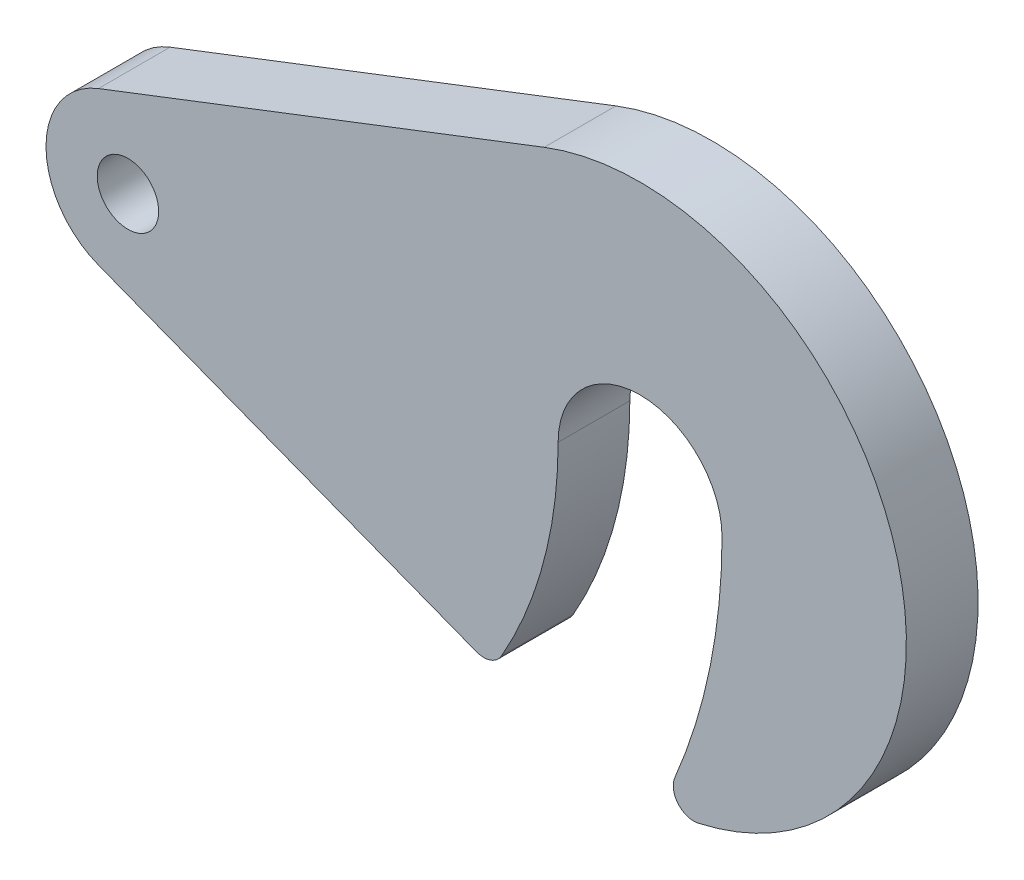
ISO-10303-21;
HEADER;
FILE_DESCRIPTION(('STEP AP214'),'2;1');
FILE_NAME('part.step','',(''),(''),'','','');
FILE_SCHEMA(('AUTOMOTIVE_DESIGN { 1 0 10303 214 1 1 1 1 }'));
ENDSEC;
DATA;
#1=APPLICATION_CONTEXT('core data for automotive mechanical design processes');
#2=APPLICATION_PROTOCOL_DEFINITION('international standard','automotive_design',2000,#1);
#3=PRODUCT_CONTEXT('',#1,'mechanical');
#4=PRODUCT('Part','Part','',(#3));
#5=PRODUCT_RELATED_PRODUCT_CATEGORY('part','',(#4));
#6=PRODUCT_DEFINITION_FORMATION('','',#4);
#7=PRODUCT_DEFINITION_CONTEXT('part definition',#1,'design');
#8=PRODUCT_DEFINITION('design','',#6,#7);
#9=PRODUCT_DEFINITION_SHAPE('','',#8);
#10=(LENGTH_UNIT() NAMED_UNIT(*) SI_UNIT(.MILLI.,.METRE.));
#11=(NAMED_UNIT(*) PLANE_ANGLE_UNIT() SI_UNIT($,.RADIAN.));
#12=(NAMED_UNIT(*) SI_UNIT($,.STERADIAN.) SOLID_ANGLE_UNIT());
#13=UNCERTAINTY_MEASURE_WITH_UNIT(LENGTH_MEASURE(1.E-05),#10,'distance_accuracy_value','');
#14=(GEOMETRIC_REPRESENTATION_CONTEXT(3) GLOBAL_UNCERTAINTY_ASSIGNED_CONTEXT((#13)) GLOBAL_UNIT_ASSIGNED_CONTEXT((#10,
#11,#12)) REPRESENTATION_CONTEXT('',''));
#15=CARTESIAN_POINT('',(0.,0.,0.));
#16=DIRECTION('',(0.,0.,1.));
#17=DIRECTION('',(1.,0.,0.));
#18=AXIS2_PLACEMENT_3D('',#15,#16,#17);
#19=CARTESIAN_POINT('',(0.,0.,7.));
#20=DIRECTION('',(0.,0.,1.));
#21=DIRECTION('',(1.,0.,0.));
#22=AXIS2_PLACEMENT_3D('',#19,#20,#21);
#23=PLANE('',#22);
#24=CARTESIAN_POINT('',(0.,0.,7.));
#25=DIRECTION('',(0.,0.,1.));
#26=DIRECTION('',(1.,0.,0.));
#27=AXIS2_PLACEMENT_3D('',#24,#25,#26);
#28=CIRCLE('',#27,42.);
#29=CARTESIAN_POINT('',(36.4726688636115,-20.8265317795677,7.));
#30=VERTEX_POINT('',#29);
#31=CARTESIAN_POINT('',(42.,0.,7.));
#32=VERTEX_POINT('',#31);
#33=EDGE_CURVE('E152',#30,#32,#28,.T.);
#34=ORIENTED_EDGE('',*,*,#33,.T.);
#35=CARTESIAN_POINT('',(50.,0.,7.));
#36=DIRECTION('',(0.,0.,-1.));
#37=DIRECTION('',(1.,0.,0.));
#38=AXIS2_PLACEMENT_3D('',#35,#36,#37);
#39=CIRCLE('',#38,7.99999999999999);
#40=CARTESIAN_POINT('',(58.,0.,7.));
#41=VERTEX_POINT('',#40);
#42=EDGE_CURVE('E95',#32,#41,#39,.T.);
#43=ORIENTED_EDGE('',*,*,#42,.T.);
#44=CARTESIAN_POINT('',(0.,0.,7.));
#45=DIRECTION('',(0.,0.,-1.));
#46=DIRECTION('',(1.,0.,0.));
#47=AXIS2_PLACEMENT_3D('',#44,#45,#46);
#48=CIRCLE('',#47,58.);
#49=CARTESIAN_POINT('',(53.3986666666667,-22.6402826444862,7.));
#50=VERTEX_POINT('',#49);
#51=EDGE_CURVE('E170',#41,#50,#48,.T.);
#52=ORIENTED_EDGE('',*,*,#51,.T.);
#53=CARTESIAN_POINT('',(55.24,-23.4209820460202,7.));
#54=DIRECTION('',(0.,0.,1.));
#55=DIRECTION('',(1.,0.,0.));
#56=AXIS2_PLACEMENT_3D('',#53,#54,#55);
#57=CIRCLE('',#56,2.);
#58=CARTESIAN_POINT('',(55.6766666666667,-25.3727305498552,7.));
#59=VERTEX_POINT('',#58);
#60=EDGE_CURVE('E187',#50,#59,#57,.T.);
#61=ORIENTED_EDGE('',*,*,#60,.T.);
#62=CARTESIAN_POINT('',(50.,0.,7.));
#63=DIRECTION('',(0.,0.,1.));
#64=DIRECTION('',(1.,0.,0.));
#65=AXIS2_PLACEMENT_3D('',#62,#63,#64);
#66=CIRCLE('',#65,26.);
#67=CARTESIAN_POINT('',(40.64,24.2567598825564,7.));
#68=VERTEX_POINT('',#67);
#69=EDGE_CURVE('E186',#59,#68,#66,.T.);
#70=ORIENTED_EDGE('',*,*,#69,.T.);
#71=DIRECTION('',(-0.932952303175248,-0.36,0.));
#72=VECTOR('',#71,1.);
#73=CARTESIAN_POINT('',(40.64,24.2567598825565,7.));
#74=LINE('',#73,#72);
#75=CARTESIAN_POINT('',(-2.88,7.46361842540199,7.));
#76=VERTEX_POINT('',#75);
#77=EDGE_CURVE('E117',#68,#76,#74,.T.);
#78=ORIENTED_EDGE('',*,*,#77,.T.);
#79=CARTESIAN_POINT('',(0.,0.,7.));
#80=DIRECTION('',(0.,0.,1.));
#81=DIRECTION('',(1.,0.,0.));
#82=AXIS2_PLACEMENT_3D('',#79,#80,#81);
#83=CIRCLE('',#82,8.);
#84=CARTESIAN_POINT('',(-2.88,-7.46361842540199,7.));
#85=VERTEX_POINT('',#84);
#86=EDGE_CURVE('E111',#76,#85,#83,.T.);
#87=ORIENTED_EDGE('',*,*,#86,.T.);
#88=DIRECTION('',(0.932952303175248,-0.36,0.));
#89=VECTOR('',#88,1.);
#90=CARTESIAN_POINT('',(-2.88,-7.46361842540199,7.));
#91=LINE('',#90,#89);
#92=CARTESIAN_POINT('',(34.0158751082015,-21.7006967773673,7.));
#93=VERTEX_POINT('',#92);
#94=EDGE_CURVE('E115',#85,#93,#91,.T.);
#95=ORIENTED_EDGE('',*,*,#94,.T.);
#96=CARTESIAN_POINT('',(34.7358751082015,-19.8347921710168,7.));
#97=DIRECTION('',(0.,0.,1.));
#98=DIRECTION('',(-1.,0.,0.));
#99=AXIS2_PLACEMENT_3D('',#96,#97,#98);
#100=CIRCLE('',#99,2.);
#101=EDGE_CURVE('E49',#93,#30,#100,.T.);
#102=ORIENTED_EDGE('',*,*,#101,.T.);
#103=EDGE_LOOP('',(#34,#43,#52,#61,#70,#78,#87,#95,#102));
#104=FACE_BOUND('',#103,.T.);
#105=CARTESIAN_POINT('',(0.,0.,7.));
#106=DIRECTION('',(0.,0.,1.));
#107=DIRECTION('',(1.,0.,0.));
#108=AXIS2_PLACEMENT_3D('',#105,#106,#107);
#109=CIRCLE('',#108,3.);
#110=CARTESIAN_POINT('',(3.,0.,7.));
#111=VERTEX_POINT('',#110);
#112=EDGE_CURVE('E139',#111,#111,#109,.T.);
#113=ORIENTED_EDGE('',*,*,#112,.F.);
#114=EDGE_LOOP('',(#113));
#115=FACE_BOUND('',#114,.T.);
#116=ADVANCED_FACE('F32',(#104,#115),#23,.T.);
#117=CARTESIAN_POINT('',(0.,0.,0.));
#118=DIRECTION('',(0.,0.,1.));
#119=DIRECTION('',(1.,0.,0.));
#120=AXIS2_PLACEMENT_3D('',#117,#118,#119);
#121=PLANE('',#120);
#122=CARTESIAN_POINT('',(0.,0.,0.));
#123=DIRECTION('',(0.,0.,1.));
#124=DIRECTION('',(1.,0.,0.));
#125=AXIS2_PLACEMENT_3D('',#122,#123,#124);
#126=CIRCLE('',#125,42.);
#127=CARTESIAN_POINT('',(36.4726688636115,-20.8265317795677,0.));
#128=VERTEX_POINT('',#127);
#129=CARTESIAN_POINT('',(42.,0.,0.));
#130=VERTEX_POINT('',#129);
#131=EDGE_CURVE('E135',#128,#130,#126,.T.);
#132=ORIENTED_EDGE('',*,*,#131,.F.);
#133=CARTESIAN_POINT('',(34.7358751082015,-19.8347921710168,0.));
#134=DIRECTION('',(0.,0.,1.));
#135=DIRECTION('',(-1.,0.,0.));
#136=AXIS2_PLACEMENT_3D('',#133,#134,#135);
#137=CIRCLE('',#136,2.);
#138=CARTESIAN_POINT('',(34.0158751082015,-21.7006967773673,0.));
#139=VERTEX_POINT('',#138);
#140=EDGE_CURVE('E87',#139,#128,#137,.T.);
#141=ORIENTED_EDGE('',*,*,#140,.F.);
#142=DIRECTION('',(0.932952303175248,-0.36,0.));
#143=VECTOR('',#142,1.);
#144=CARTESIAN_POINT('',(-2.88,-7.46361842540199,0.));
#145=LINE('',#144,#143);
#146=CARTESIAN_POINT('',(-2.88,-7.46361842540199,0.));
#147=VERTEX_POINT('',#146);
#148=EDGE_CURVE('E81',#147,#139,#145,.T.);
#149=ORIENTED_EDGE('',*,*,#148,.F.);
#150=CARTESIAN_POINT('',(0.,0.,0.));
#151=DIRECTION('',(0.,0.,1.));
#152=DIRECTION('',(1.,0.,0.));
#153=AXIS2_PLACEMENT_3D('',#150,#151,#152);
#154=CIRCLE('',#153,8.);
#155=CARTESIAN_POINT('',(-2.88,7.46361842540199,0.));
#156=VERTEX_POINT('',#155);
#157=EDGE_CURVE('E125',#156,#147,#154,.T.);
#158=ORIENTED_EDGE('',*,*,#157,.F.);
#159=DIRECTION('',(-0.932952303175248,-0.36,0.));
#160=VECTOR('',#159,1.);
#161=CARTESIAN_POINT('',(40.64,24.2567598825565,0.));
#162=LINE('',#161,#160);
#163=CARTESIAN_POINT('',(40.64,24.2567598825564,0.));
#164=VERTEX_POINT('',#163);
#165=EDGE_CURVE('E147',#164,#156,#162,.T.);
#166=ORIENTED_EDGE('',*,*,#165,.F.);
#167=CARTESIAN_POINT('',(50.,0.,0.));
#168=DIRECTION('',(0.,0.,1.));
#169=DIRECTION('',(1.,0.,0.));
#170=AXIS2_PLACEMENT_3D('',#167,#168,#169);
#171=CIRCLE('',#170,26.);
#172=CARTESIAN_POINT('',(55.6766666666667,-25.3727305498552,0.));
#173=VERTEX_POINT('',#172);
#174=EDGE_CURVE('E145',#173,#164,#171,.T.);
#175=ORIENTED_EDGE('',*,*,#174,.F.);
#176=CARTESIAN_POINT('',(55.24,-23.4209820460202,0.));
#177=DIRECTION('',(0.,0.,1.));
#178=DIRECTION('',(1.,0.,0.));
#179=AXIS2_PLACEMENT_3D('',#176,#177,#178);
#180=CIRCLE('',#179,2.);
#181=CARTESIAN_POINT('',(53.3986666666667,-22.6402826444862,0.));
#182=VERTEX_POINT('',#181);
#183=EDGE_CURVE('E143',#182,#173,#180,.T.);
#184=ORIENTED_EDGE('',*,*,#183,.F.);
#185=CARTESIAN_POINT('',(0.,0.,0.));
#186=DIRECTION('',(0.,0.,-1.));
#187=DIRECTION('',(1.,0.,0.));
#188=AXIS2_PLACEMENT_3D('',#185,#186,#187);
#189=CIRCLE('',#188,58.);
#190=CARTESIAN_POINT('',(58.,0.,0.));
#191=VERTEX_POINT('',#190);
#192=EDGE_CURVE('E141',#191,#182,#189,.T.);
#193=ORIENTED_EDGE('',*,*,#192,.F.);
#194=CARTESIAN_POINT('',(50.,0.,0.));
#195=DIRECTION('',(0.,0.,-1.));
#196=DIRECTION('',(1.,0.,0.));
#197=AXIS2_PLACEMENT_3D('',#194,#195,#196);
#198=CIRCLE('',#197,7.99999999999999);
#199=EDGE_CURVE('E138',#130,#191,#198,.T.);
#200=ORIENTED_EDGE('',*,*,#199,.F.);
#201=EDGE_LOOP('',(#132,#141,#149,#158,#166,#175,#184,#193,#200));
#202=FACE_BOUND('',#201,.T.);
#203=CARTESIAN_POINT('',(0.,0.,0.));
#204=DIRECTION('',(0.,0.,1.));
#205=DIRECTION('',(1.,0.,0.));
#206=AXIS2_PLACEMENT_3D('',#203,#204,#205);
#207=CIRCLE('',#206,3.);
#208=CARTESIAN_POINT('',(3.,0.,0.));
#209=VERTEX_POINT('',#208);
#210=EDGE_CURVE('E194',#209,#209,#207,.T.);
#211=ORIENTED_EDGE('',*,*,#210,.T.);
#212=EDGE_LOOP('',(#211));
#213=FACE_BOUND('',#212,.T.);
#214=ADVANCED_FACE('F174',(#202,#213),#121,.F.);
#215=CARTESIAN_POINT('',(0.,0.,7.));
#216=DIRECTION('',(0.,0.,-1.));
#217=DIRECTION('',(-1.,0.,0.));
#218=AXIS2_PLACEMENT_3D('',#215,#216,#217);
#219=CYLINDRICAL_SURFACE('',#218,42.);
#220=ORIENTED_EDGE('',*,*,#131,.T.);
#221=DIRECTION('',(0.,0.,-1.));
#222=VECTOR('',#221,1.);
#223=CARTESIAN_POINT('',(42.,0.,7.));
#224=LINE('',#223,#222);
#225=EDGE_CURVE('E11',#32,#130,#224,.T.);
#226=ORIENTED_EDGE('',*,*,#225,.F.);
#227=ORIENTED_EDGE('',*,*,#33,.F.);
#228=DIRECTION('',(0.,0.,-1.));
#229=VECTOR('',#228,1.);
#230=CARTESIAN_POINT('',(36.4726688636115,-20.8265317795677,7.));
#231=LINE('',#230,#229);
#232=EDGE_CURVE('E131',#30,#128,#231,.T.);
#233=ORIENTED_EDGE('',*,*,#232,.T.);
#234=EDGE_LOOP('',(#220,#226,#227,#233));
#235=FACE_BOUND('',#234,.T.);
#236=ADVANCED_FACE('F34',(#235),#219,.T.);
#237=CARTESIAN_POINT('',(50.,0.,7.));
#238=DIRECTION('',(0.,0.,-1.));
#239=DIRECTION('',(-1.,0.,0.));
#240=AXIS2_PLACEMENT_3D('',#237,#238,#239);
#241=CYLINDRICAL_SURFACE('',#240,7.99999999999999);
#242=ORIENTED_EDGE('',*,*,#199,.T.);
#243=DIRECTION('',(0.,0.,-1.));
#244=VECTOR('',#243,1.);
#245=CARTESIAN_POINT('',(58.,0.,7.));
#246=LINE('',#245,#244);
#247=EDGE_CURVE('E41',#41,#191,#246,.T.);
#248=ORIENTED_EDGE('',*,*,#247,.F.);
#249=ORIENTED_EDGE('',*,*,#42,.F.);
#250=ORIENTED_EDGE('',*,*,#225,.T.);
#251=EDGE_LOOP('',(#242,#248,#249,#250));
#252=FACE_BOUND('',#251,.T.);
#253=ADVANCED_FACE('F226',(#252),#241,.F.);
#254=CARTESIAN_POINT('',(0.,0.,7.));
#255=DIRECTION('',(0.,0.,-1.));
#256=DIRECTION('',(-1.,0.,0.));
#257=AXIS2_PLACEMENT_3D('',#254,#255,#256);
#258=CYLINDRICAL_SURFACE('',#257,58.);
#259=ORIENTED_EDGE('',*,*,#192,.T.);
#260=DIRECTION('',(0.,0.,-1.));
#261=VECTOR('',#260,1.);
#262=CARTESIAN_POINT('',(53.3986666666667,-22.6402826444862,7.));
#263=LINE('',#262,#261);
#264=EDGE_CURVE('E162',#50,#182,#263,.T.);
#265=ORIENTED_EDGE('',*,*,#264,.F.);
#266=ORIENTED_EDGE('',*,*,#51,.F.);
#267=ORIENTED_EDGE('',*,*,#247,.T.);
#268=EDGE_LOOP('',(#259,#265,#266,#267));
#269=FACE_BOUND('',#268,.T.);
#270=ADVANCED_FACE('F168',(#269),#258,.F.);
#271=CARTESIAN_POINT('',(55.24,-23.4209820460202,7.));
#272=DIRECTION('',(0.,0.,-1.));
#273=DIRECTION('',(-1.,0.,0.));
#274=AXIS2_PLACEMENT_3D('',#271,#272,#273);
#275=CYLINDRICAL_SURFACE('',#274,2.);
#276=ORIENTED_EDGE('',*,*,#183,.T.);
#277=DIRECTION('',(0.,0.,-1.));
#278=VECTOR('',#277,1.);
#279=CARTESIAN_POINT('',(55.6766666666667,-25.3727305498552,7.));
#280=LINE('',#279,#278);
#281=EDGE_CURVE('E159',#59,#173,#280,.T.);
#282=ORIENTED_EDGE('',*,*,#281,.F.);
#283=ORIENTED_EDGE('',*,*,#60,.F.);
#284=ORIENTED_EDGE('',*,*,#264,.T.);
#285=EDGE_LOOP('',(#276,#282,#283,#284));
#286=FACE_BOUND('',#285,.T.);
#287=ADVANCED_FACE('F180',(#286),#275,.T.);
#288=CARTESIAN_POINT('',(50.,0.,7.));
#289=DIRECTION('',(0.,0.,-1.));
#290=DIRECTION('',(-1.,0.,0.));
#291=AXIS2_PLACEMENT_3D('',#288,#289,#290);
#292=CYLINDRICAL_SURFACE('',#291,26.);
#293=ORIENTED_EDGE('',*,*,#174,.T.);
#294=DIRECTION('',(0.,0.,-1.));
#295=VECTOR('',#294,1.);
#296=CARTESIAN_POINT('',(40.64,24.2567598825564,7.));
#297=LINE('',#296,#295);
#298=EDGE_CURVE('E156',#68,#164,#297,.T.);
#299=ORIENTED_EDGE('',*,*,#298,.F.);
#300=ORIENTED_EDGE('',*,*,#69,.F.);
#301=ORIENTED_EDGE('',*,*,#281,.T.);
#302=EDGE_LOOP('',(#293,#299,#300,#301));
#303=FACE_BOUND('',#302,.T.);
#304=ADVANCED_FACE('F184',(#303),#292,.T.);
#305=CARTESIAN_POINT('',(40.64,24.2567598825565,7.));
#306=DIRECTION('',(0.36,-0.932952303175248,0.));
#307=DIRECTION('',(0.932952303175248,0.36,0.));
#308=AXIS2_PLACEMENT_3D('',#305,#306,#307);
#309=PLANE('',#308);
#310=ORIENTED_EDGE('',*,*,#165,.T.);
#311=DIRECTION('',(0.,0.,-1.));
#312=VECTOR('',#311,1.);
#313=CARTESIAN_POINT('',(-2.88,7.46361842540199,7.));
#314=LINE('',#313,#312);
#315=EDGE_CURVE('E126',#76,#156,#314,.T.);
#316=ORIENTED_EDGE('',*,*,#315,.F.);
#317=ORIENTED_EDGE('',*,*,#77,.F.);
#318=ORIENTED_EDGE('',*,*,#298,.T.);
#319=EDGE_LOOP('',(#310,#316,#317,#318));
#320=FACE_BOUND('',#319,.T.);
#321=ADVANCED_FACE('F217',(#320),#309,.F.);
#322=CARTESIAN_POINT('',(0.,0.,7.));
#323=DIRECTION('',(0.,0.,-1.));
#324=DIRECTION('',(-1.,0.,0.));
#325=AXIS2_PLACEMENT_3D('',#322,#323,#324);
#326=CYLINDRICAL_SURFACE('',#325,8.);
#327=ORIENTED_EDGE('',*,*,#157,.T.);
#328=DIRECTION('',(0.,0.,-1.));
#329=VECTOR('',#328,1.);
#330=CARTESIAN_POINT('',(-2.88,-7.46361842540199,7.));
#331=LINE('',#330,#329);
#332=EDGE_CURVE('E122',#85,#147,#331,.T.);
#333=ORIENTED_EDGE('',*,*,#332,.F.);
#334=ORIENTED_EDGE('',*,*,#86,.F.);
#335=ORIENTED_EDGE('',*,*,#315,.T.);
#336=EDGE_LOOP('',(#327,#333,#334,#335));
#337=FACE_BOUND('',#336,.T.);
#338=ADVANCED_FACE('F123',(#337),#326,.T.);
#339=CARTESIAN_POINT('',(-2.88,-7.46361842540199,7.));
#340=DIRECTION('',(0.36,0.932952303175248,0.));
#341=DIRECTION('',(-0.932952303175248,0.36,0.));
#342=AXIS2_PLACEMENT_3D('',#339,#340,#341);
#343=PLANE('',#342);
#344=ORIENTED_EDGE('',*,*,#148,.T.);
#345=DIRECTION('',(0.,0.,-1.));
#346=VECTOR('',#345,1.);
#347=CARTESIAN_POINT('',(34.0158751082015,-21.7006967773673,7.));
#348=LINE('',#347,#346);
#349=EDGE_CURVE('E127',#93,#139,#348,.T.);
#350=ORIENTED_EDGE('',*,*,#349,.F.);
#351=ORIENTED_EDGE('',*,*,#94,.F.);
#352=ORIENTED_EDGE('',*,*,#332,.T.);
#353=EDGE_LOOP('',(#344,#350,#351,#352));
#354=FACE_BOUND('',#353,.T.);
#355=ADVANCED_FACE('F129',(#354),#343,.F.);
#356=CARTESIAN_POINT('',(34.7358751082015,-19.8347921710168,7.));
#357=DIRECTION('',(0.,0.,-1.));
#358=DIRECTION('',(-1.,0.,0.));
#359=AXIS2_PLACEMENT_3D('',#356,#357,#358);
#360=CYLINDRICAL_SURFACE('',#359,2.);
#361=ORIENTED_EDGE('',*,*,#140,.T.);
#362=ORIENTED_EDGE('',*,*,#232,.F.);
#363=ORIENTED_EDGE('',*,*,#101,.F.);
#364=ORIENTED_EDGE('',*,*,#349,.T.);
#365=EDGE_LOOP('',(#361,#362,#363,#364));
#366=FACE_BOUND('',#365,.T.);
#367=ADVANCED_FACE('F210',(#366),#360,.T.);
#368=CARTESIAN_POINT('',(0.,0.,7.));
#369=DIRECTION('',(0.,0.,-1.));
#370=DIRECTION('',(-1.,0.,0.));
#371=AXIS2_PLACEMENT_3D('',#368,#369,#370);
#372=CYLINDRICAL_SURFACE('',#371,3.);
#373=ORIENTED_EDGE('',*,*,#112,.T.);
#374=EDGE_LOOP('',(#373));
#375=FACE_BOUND('',#374,.T.);
#376=ORIENTED_EDGE('',*,*,#210,.F.);
#377=EDGE_LOOP('',(#376));
#378=FACE_BOUND('',#377,.T.);
#379=ADVANCED_FACE('F200',(#375,#378),#372,.F.);
#380=CLOSED_SHELL('',(#116,#214,#236,#253,#270,#287,#304,#321,#338,#355,#367,#379));
#381=MANIFOLD_SOLID_BREP('B2',#380);
#382=ADVANCED_BREP_SHAPE_REPRESENTATION('',(#18,#381),#14);
#383=SHAPE_DEFINITION_REPRESENTATION(#9,#382);
ENDSEC;
END-ISO-10303-21;
